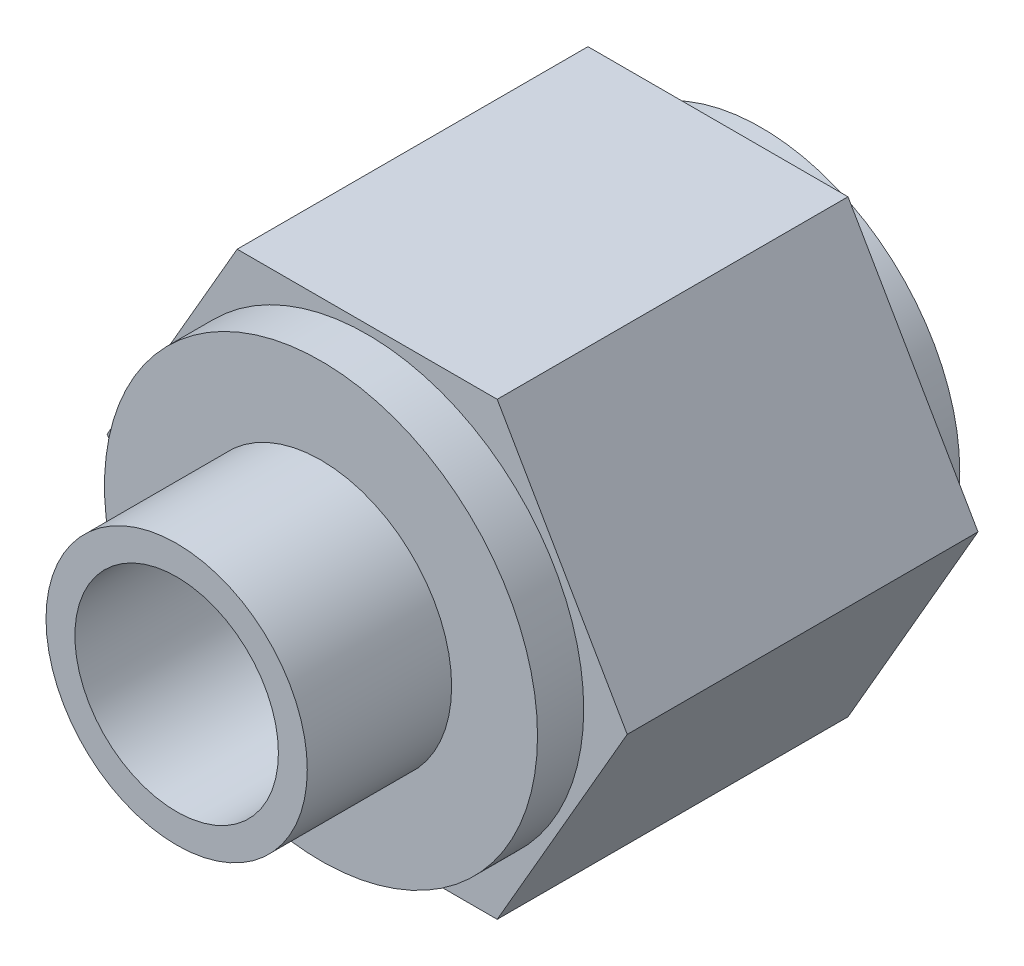
ISO-10303-21;
HEADER;
FILE_DESCRIPTION(('STEP AP214'),'2;1');
FILE_NAME('part.step','',(''),(''),'','','');
FILE_SCHEMA(('AUTOMOTIVE_DESIGN { 1 0 10303 214 1 1 1 1 }'));
ENDSEC;
DATA;
#1=APPLICATION_CONTEXT('core data for automotive mechanical design processes');
#2=APPLICATION_PROTOCOL_DEFINITION('international standard','automotive_design',2000,#1);
#3=PRODUCT_CONTEXT('',#1,'mechanical');
#4=PRODUCT('Part','Part','',(#3));
#5=PRODUCT_RELATED_PRODUCT_CATEGORY('part','',(#4));
#6=PRODUCT_DEFINITION_FORMATION('','',#4);
#7=PRODUCT_DEFINITION_CONTEXT('part definition',#1,'design');
#8=PRODUCT_DEFINITION('design','',#6,#7);
#9=PRODUCT_DEFINITION_SHAPE('','',#8);
#10=(LENGTH_UNIT() NAMED_UNIT(*) SI_UNIT(.MILLI.,.METRE.));
#11=(NAMED_UNIT(*) PLANE_ANGLE_UNIT() SI_UNIT($,.RADIAN.));
#12=(NAMED_UNIT(*) SI_UNIT($,.STERADIAN.) SOLID_ANGLE_UNIT());
#13=UNCERTAINTY_MEASURE_WITH_UNIT(LENGTH_MEASURE(1.E-05),#10,'distance_accuracy_value','');
#14=(GEOMETRIC_REPRESENTATION_CONTEXT(3) GLOBAL_UNCERTAINTY_ASSIGNED_CONTEXT((#13)) GLOBAL_UNIT_ASSIGNED_CONTEXT((#10,
#11,#12)) REPRESENTATION_CONTEXT('',''));
#15=CARTESIAN_POINT('',(0.,0.,0.));
#16=DIRECTION('',(0.,0.,1.));
#17=DIRECTION('',(1.,0.,0.));
#18=AXIS2_PLACEMENT_3D('',#15,#16,#17);
#19=CARTESIAN_POINT('',(0.,0.,-7.51840000000001));
#20=DIRECTION('',(0.,0.,1.));
#21=DIRECTION('',(1.,0.,0.));
#22=AXIS2_PLACEMENT_3D('',#19,#20,#21);
#23=PLANE('',#22);
#24=CARTESIAN_POINT('',(0.,0.,-7.51840000000001));
#25=DIRECTION('',(0.,0.,-1.));
#26=DIRECTION('',(-1.,0.,0.));
#27=AXIS2_PLACEMENT_3D('',#24,#25,#26);
#28=CIRCLE('',#27,3.17500000000001);
#29=CARTESIAN_POINT('',(-3.17500000000001,0.,-7.51840000000001));
#30=VERTEX_POINT('',#29);
#31=EDGE_CURVE('E221',#30,#30,#28,.T.);
#32=ORIENTED_EDGE('',*,*,#31,.T.);
#33=EDGE_LOOP('',(#32));
#34=FACE_BOUND('',#33,.T.);
#35=CARTESIAN_POINT('',(0.,0.,-7.51840000000001));
#36=DIRECTION('',(0.,0.,1.));
#37=DIRECTION('',(1.,0.,0.));
#38=AXIS2_PLACEMENT_3D('',#35,#36,#37);
#39=CIRCLE('',#38,0.381);
#40=CARTESIAN_POINT('',(0.381,0.,-7.51840000000001));
#41=VERTEX_POINT('',#40);
#42=EDGE_CURVE('E11',#41,#41,#39,.F.);
#43=ORIENTED_EDGE('',*,*,#42,.F.);
#44=EDGE_LOOP('',(#43));
#45=FACE_BOUND('',#44,.T.);
#46=ADVANCED_FACE('F40',(#34,#45),#23,.F.);
#47=CARTESIAN_POINT('',(-4.57538541327462,1.78687214890029E-13,-9.525));
#48=DIRECTION('',(0.,0.,1.));
#49=DIRECTION('',(1.,0.,0.));
#50=AXIS2_PLACEMENT_3D('',#47,#48,#49);
#51=PLANE('',#50);
#52=DIRECTION('',(-0.5,-0.866025403784439,0.));
#53=VECTOR('',#52,1.);
#54=CARTESIAN_POINT('',(-2.28769270663755,3.96240000000034,-9.525));
#55=LINE('',#54,#53);
#56=CARTESIAN_POINT('',(-2.28769270663755,3.96240000000034,-9.525));
#57=VERTEX_POINT('',#56);
#58=CARTESIAN_POINT('',(-4.57538541327461,1.77619534868055E-13,-9.525));
#59=VERTEX_POINT('',#58);
#60=EDGE_CURVE('E147',#57,#59,#55,.T.);
#61=ORIENTED_EDGE('',*,*,#60,.F.);
#62=DIRECTION('',(-1.,0.,0.));
#63=VECTOR('',#62,1.);
#64=CARTESIAN_POINT('',(2.28769270663665,3.96240000000034,-9.525));
#65=LINE('',#64,#63);
#66=CARTESIAN_POINT('',(2.28769270663665,3.96240000000034,-9.525));
#67=VERTEX_POINT('',#66);
#68=EDGE_CURVE('E121',#67,#57,#65,.T.);
#69=ORIENTED_EDGE('',*,*,#68,.F.);
#70=DIRECTION('',(-0.5,0.866025403784439,0.));
#71=VECTOR('',#70,1.);
#72=CARTESIAN_POINT('',(4.57538541327394,-2.18400137372289E-13,-9.525));
#73=LINE('',#72,#71);
#74=CARTESIAN_POINT('',(4.57538541327394,-2.18400137372289E-13,-9.525));
#75=VERTEX_POINT('',#74);
#76=EDGE_CURVE('E104',#75,#67,#73,.T.);
#77=ORIENTED_EDGE('',*,*,#76,.F.);
#78=DIRECTION('',(0.5,0.866025403784439,0.));
#79=VECTOR('',#78,1.);
#80=CARTESIAN_POINT('',(2.28769270663688,-3.96240000000036,-9.525));
#81=LINE('',#80,#79);
#82=CARTESIAN_POINT('',(2.28769270663688,-3.96240000000036,-9.525));
#83=VERTEX_POINT('',#82);
#84=EDGE_CURVE('E119',#83,#75,#81,.T.);
#85=ORIENTED_EDGE('',*,*,#84,.F.);
#86=DIRECTION('',(1.,0.,0.));
#87=VECTOR('',#86,1.);
#88=CARTESIAN_POINT('',(-2.28769270663733,-3.96240000000036,-9.525));
#89=LINE('',#88,#87);
#90=CARTESIAN_POINT('',(-2.28769270663733,-3.96240000000036,-9.525));
#91=VERTEX_POINT('',#90);
#92=EDGE_CURVE('E124',#91,#83,#89,.T.);
#93=ORIENTED_EDGE('',*,*,#92,.F.);
#94=DIRECTION('',(0.5,-0.866025403784439,0.));
#95=VECTOR('',#94,1.);
#96=CARTESIAN_POINT('',(-4.57538541327461,1.77619534868055E-13,-9.525));
#97=LINE('',#96,#95);
#98=EDGE_CURVE('E126',#59,#91,#97,.T.);
#99=ORIENTED_EDGE('',*,*,#98,.F.);
#100=EDGE_LOOP('',(#61,#69,#77,#85,#93,#99));
#101=FACE_BOUND('',#100,.T.);
#102=CARTESIAN_POINT('',(0.,0.,-9.525));
#103=DIRECTION('',(0.,0.,1.));
#104=DIRECTION('',(1.,0.,0.));
#105=AXIS2_PLACEMENT_3D('',#102,#103,#104);
#106=CIRCLE('',#105,3.4925);
#107=CARTESIAN_POINT('',(3.4925,0.,-9.525));
#108=VERTEX_POINT('',#107);
#109=EDGE_CURVE('E50',#108,#108,#106,.F.);
#110=ORIENTED_EDGE('',*,*,#109,.F.);
#111=EDGE_LOOP('',(#110));
#112=FACE_BOUND('',#111,.T.);
#113=ADVANCED_FACE('F116',(#101,#112),#51,.F.);
#114=CARTESIAN_POINT('',(0.,0.,-2.54));
#115=DIRECTION('',(0.,0.,1.));
#116=DIRECTION('',(1.,0.,0.));
#117=AXIS2_PLACEMENT_3D('',#114,#115,#116);
#118=PLANE('',#117);
#119=CARTESIAN_POINT('',(0.,0.,-2.54));
#120=DIRECTION('',(0.,0.,1.));
#121=DIRECTION('',(1.,0.,0.));
#122=AXIS2_PLACEMENT_3D('',#119,#120,#121);
#123=CIRCLE('',#122,3.81);
#124=CARTESIAN_POINT('',(3.81,0.,-2.54));
#125=VERTEX_POINT('',#124);
#126=EDGE_CURVE('E135',#125,#125,#123,.T.);
#127=ORIENTED_EDGE('',*,*,#126,.T.);
#128=EDGE_LOOP('',(#127));
#129=FACE_BOUND('',#128,.T.);
#130=CARTESIAN_POINT('',(0.,0.,-2.54));
#131=DIRECTION('',(0.,0.,1.));
#132=DIRECTION('',(1.,0.,0.));
#133=AXIS2_PLACEMENT_3D('',#130,#131,#132);
#134=CIRCLE('',#133,2.2987);
#135=CARTESIAN_POINT('',(2.2987,0.,-2.54));
#136=VERTEX_POINT('',#135);
#137=EDGE_CURVE('E210',#136,#136,#134,.T.);
#138=ORIENTED_EDGE('',*,*,#137,.F.);
#139=EDGE_LOOP('',(#138));
#140=FACE_BOUND('',#139,.T.);
#141=ADVANCED_FACE('F164',(#129,#140),#118,.T.);
#142=CARTESIAN_POINT('',(-4.57538541327462,1.78687214890029E-13,-3.3528));
#143=DIRECTION('',(0.,0.,1.));
#144=DIRECTION('',(1.,0.,0.));
#145=AXIS2_PLACEMENT_3D('',#142,#143,#144);
#146=PLANE('',#145);
#147=DIRECTION('',(-0.5,-0.866025403784439,0.));
#148=VECTOR('',#147,1.);
#149=CARTESIAN_POINT('',(-2.28769270663755,3.96240000000034,-3.3528));
#150=LINE('',#149,#148);
#151=CARTESIAN_POINT('',(-2.28769270663755,3.96240000000034,-3.3528));
#152=VERTEX_POINT('',#151);
#153=CARTESIAN_POINT('',(-4.57538541327461,1.77619534868055E-13,-3.3528));
#154=VERTEX_POINT('',#153);
#155=EDGE_CURVE('E131',#152,#154,#150,.T.);
#156=ORIENTED_EDGE('',*,*,#155,.T.);
#157=DIRECTION('',(0.5,-0.866025403784439,0.));
#158=VECTOR('',#157,1.);
#159=CARTESIAN_POINT('',(-4.57538541327461,1.77619534868055E-13,-3.3528));
#160=LINE('',#159,#158);
#161=CARTESIAN_POINT('',(-2.28769270663733,-3.96240000000036,-3.3528));
#162=VERTEX_POINT('',#161);
#163=EDGE_CURVE('E134',#154,#162,#160,.T.);
#164=ORIENTED_EDGE('',*,*,#163,.T.);
#165=DIRECTION('',(1.,0.,0.));
#166=VECTOR('',#165,1.);
#167=CARTESIAN_POINT('',(-2.28769270663733,-3.96240000000036,-3.3528));
#168=LINE('',#167,#166);
#169=CARTESIAN_POINT('',(2.28769270663688,-3.96240000000036,-3.3528));
#170=VERTEX_POINT('',#169);
#171=EDGE_CURVE('E138',#162,#170,#168,.T.);
#172=ORIENTED_EDGE('',*,*,#171,.T.);
#173=DIRECTION('',(0.5,0.866025403784439,0.));
#174=VECTOR('',#173,1.);
#175=CARTESIAN_POINT('',(2.28769270663688,-3.96240000000036,-3.3528));
#176=LINE('',#175,#174);
#177=CARTESIAN_POINT('',(4.57538541327394,-2.18400137372289E-13,-3.3528));
#178=VERTEX_POINT('',#177);
#179=EDGE_CURVE('E141',#170,#178,#176,.T.);
#180=ORIENTED_EDGE('',*,*,#179,.T.);
#181=DIRECTION('',(-0.5,0.866025403784439,0.));
#182=VECTOR('',#181,1.);
#183=CARTESIAN_POINT('',(4.57538541327394,-2.18400137372289E-13,-3.3528));
#184=LINE('',#183,#182);
#185=CARTESIAN_POINT('',(2.28769270663665,3.96240000000034,-3.3528));
#186=VERTEX_POINT('',#185);
#187=EDGE_CURVE('E106',#178,#186,#184,.T.);
#188=ORIENTED_EDGE('',*,*,#187,.T.);
#189=DIRECTION('',(-1.,0.,0.));
#190=VECTOR('',#189,1.);
#191=CARTESIAN_POINT('',(2.28769270663665,3.96240000000034,-3.3528));
#192=LINE('',#191,#190);
#193=EDGE_CURVE('E144',#186,#152,#192,.T.);
#194=ORIENTED_EDGE('',*,*,#193,.T.);
#195=EDGE_LOOP('',(#156,#164,#172,#180,#188,#194));
#196=FACE_BOUND('',#195,.T.);
#197=CARTESIAN_POINT('',(0.,0.,-3.3528));
#198=DIRECTION('',(0.,0.,1.));
#199=DIRECTION('',(1.,0.,0.));
#200=AXIS2_PLACEMENT_3D('',#197,#198,#199);
#201=CIRCLE('',#200,3.81);
#202=CARTESIAN_POINT('',(3.81,0.,-3.3528));
#203=VERTEX_POINT('',#202);
#204=EDGE_CURVE('E202',#203,#203,#201,.T.);
#205=ORIENTED_EDGE('',*,*,#204,.F.);
#206=EDGE_LOOP('',(#205));
#207=FACE_BOUND('',#206,.T.);
#208=ADVANCED_FACE('F170',(#196,#207),#146,.T.);
#209=CARTESIAN_POINT('',(-2.28769270663755,3.96240000000034,-9.525));
#210=DIRECTION('',(-0.866025403784439,0.5,0.));
#211=DIRECTION('',(-0.5,-0.866025403784439,0.));
#212=AXIS2_PLACEMENT_3D('',#209,#210,#211);
#213=PLANE('',#212);
#214=ORIENTED_EDGE('',*,*,#155,.F.);
#215=DIRECTION('',(0.,0.,1.));
#216=VECTOR('',#215,1.);
#217=CARTESIAN_POINT('',(-2.28769270663755,3.96240000000034,-9.525));
#218=LINE('',#217,#216);
#219=EDGE_CURVE('E58',#57,#152,#218,.T.);
#220=ORIENTED_EDGE('',*,*,#219,.F.);
#221=ORIENTED_EDGE('',*,*,#60,.T.);
#222=DIRECTION('',(0.,0.,1.));
#223=VECTOR('',#222,1.);
#224=CARTESIAN_POINT('',(-4.57538541327461,1.77619534868055E-13,-9.525));
#225=LINE('',#224,#223);
#226=EDGE_CURVE('E93',#59,#154,#225,.T.);
#227=ORIENTED_EDGE('',*,*,#226,.T.);
#228=EDGE_LOOP('',(#214,#220,#221,#227));
#229=FACE_BOUND('',#228,.T.);
#230=ADVANCED_FACE('F42',(#229),#213,.T.);
#231=CARTESIAN_POINT('',(2.28769270663665,3.96240000000034,-9.525));
#232=DIRECTION('',(0.,1.,0.));
#233=DIRECTION('',(0.,0.,1.));
#234=AXIS2_PLACEMENT_3D('',#231,#232,#233);
#235=PLANE('',#234);
#236=ORIENTED_EDGE('',*,*,#193,.F.);
#237=DIRECTION('',(0.,0.,1.));
#238=VECTOR('',#237,1.);
#239=CARTESIAN_POINT('',(2.28769270663665,3.96240000000034,-9.525));
#240=LINE('',#239,#238);
#241=EDGE_CURVE('E81',#67,#186,#240,.T.);
#242=ORIENTED_EDGE('',*,*,#241,.F.);
#243=ORIENTED_EDGE('',*,*,#68,.T.);
#244=ORIENTED_EDGE('',*,*,#219,.T.);
#245=EDGE_LOOP('',(#236,#242,#243,#244));
#246=FACE_BOUND('',#245,.T.);
#247=ADVANCED_FACE('F181',(#246),#235,.T.);
#248=CARTESIAN_POINT('',(4.57538541327394,-2.18400137372289E-13,-9.525));
#249=DIRECTION('',(0.866025403784439,0.5,0.));
#250=DIRECTION('',(-0.5,0.866025403784439,0.));
#251=AXIS2_PLACEMENT_3D('',#248,#249,#250);
#252=PLANE('',#251);
#253=ORIENTED_EDGE('',*,*,#187,.F.);
#254=DIRECTION('',(0.,0.,1.));
#255=VECTOR('',#254,1.);
#256=CARTESIAN_POINT('',(4.57538541327394,-2.18400137372289E-13,-9.525));
#257=LINE('',#256,#255);
#258=EDGE_CURVE('E101',#75,#178,#257,.T.);
#259=ORIENTED_EDGE('',*,*,#258,.F.);
#260=ORIENTED_EDGE('',*,*,#76,.T.);
#261=ORIENTED_EDGE('',*,*,#241,.T.);
#262=EDGE_LOOP('',(#253,#259,#260,#261));
#263=FACE_BOUND('',#262,.T.);
#264=ADVANCED_FACE('F103',(#263),#252,.T.);
#265=CARTESIAN_POINT('',(2.28769270663688,-3.96240000000036,-9.525));
#266=DIRECTION('',(0.866025403784439,-0.5,0.));
#267=DIRECTION('',(0.5,0.866025403784439,0.));
#268=AXIS2_PLACEMENT_3D('',#265,#266,#267);
#269=PLANE('',#268);
#270=ORIENTED_EDGE('',*,*,#179,.F.);
#271=DIRECTION('',(0.,0.,1.));
#272=VECTOR('',#271,1.);
#273=CARTESIAN_POINT('',(2.28769270663688,-3.96240000000036,-9.525));
#274=LINE('',#273,#272);
#275=EDGE_CURVE('E112',#83,#170,#274,.T.);
#276=ORIENTED_EDGE('',*,*,#275,.F.);
#277=ORIENTED_EDGE('',*,*,#84,.T.);
#278=ORIENTED_EDGE('',*,*,#258,.T.);
#279=EDGE_LOOP('',(#270,#276,#277,#278));
#280=FACE_BOUND('',#279,.T.);
#281=ADVANCED_FACE('F123',(#280),#269,.T.);
#282=CARTESIAN_POINT('',(-2.28769270663733,-3.96240000000036,-9.525));
#283=DIRECTION('',(0.,-1.,0.));
#284=DIRECTION('',(0.,0.,-1.));
#285=AXIS2_PLACEMENT_3D('',#282,#283,#284);
#286=PLANE('',#285);
#287=ORIENTED_EDGE('',*,*,#171,.F.);
#288=DIRECTION('',(0.,0.,1.));
#289=VECTOR('',#288,1.);
#290=CARTESIAN_POINT('',(-2.28769270663733,-3.96240000000036,-9.525));
#291=LINE('',#290,#289);
#292=EDGE_CURVE('E153',#91,#162,#291,.T.);
#293=ORIENTED_EDGE('',*,*,#292,.F.);
#294=ORIENTED_EDGE('',*,*,#92,.T.);
#295=ORIENTED_EDGE('',*,*,#275,.T.);
#296=EDGE_LOOP('',(#287,#293,#294,#295));
#297=FACE_BOUND('',#296,.T.);
#298=ADVANCED_FACE('F188',(#297),#286,.T.);
#299=CARTESIAN_POINT('',(-4.57538541327461,1.77619534868055E-13,-9.525));
#300=DIRECTION('',(-0.866025403784439,-0.5,0.));
#301=DIRECTION('',(0.5,-0.866025403784439,0.));
#302=AXIS2_PLACEMENT_3D('',#299,#300,#301);
#303=PLANE('',#302);
#304=ORIENTED_EDGE('',*,*,#163,.F.);
#305=ORIENTED_EDGE('',*,*,#226,.F.);
#306=ORIENTED_EDGE('',*,*,#98,.T.);
#307=ORIENTED_EDGE('',*,*,#292,.T.);
#308=EDGE_LOOP('',(#304,#305,#306,#307));
#309=FACE_BOUND('',#308,.T.);
#310=ADVANCED_FACE('F190',(#309),#303,.T.);
#311=CARTESIAN_POINT('',(0.,0.,-2.54));
#312=DIRECTION('',(0.,0.,-1.));
#313=DIRECTION('',(-1.,0.,0.));
#314=AXIS2_PLACEMENT_3D('',#311,#312,#313);
#315=CYLINDRICAL_SURFACE('',#314,3.81);
#316=ORIENTED_EDGE('',*,*,#126,.F.);
#317=EDGE_LOOP('',(#316));
#318=FACE_BOUND('',#317,.T.);
#319=ORIENTED_EDGE('',*,*,#204,.T.);
#320=EDGE_LOOP('',(#319));
#321=FACE_BOUND('',#320,.T.);
#322=ADVANCED_FACE('F177',(#318,#321),#315,.T.);
#323=CARTESIAN_POINT('',(0.,0.,0.));
#324=DIRECTION('',(0.,0.,-1.));
#325=DIRECTION('',(-1.,0.,0.));
#326=AXIS2_PLACEMENT_3D('',#323,#324,#325);
#327=CYLINDRICAL_SURFACE('',#326,2.2987);
#328=CARTESIAN_POINT('',(0.,0.,0.));
#329=DIRECTION('',(0.,0.,1.));
#330=DIRECTION('',(1.,0.,0.));
#331=AXIS2_PLACEMENT_3D('',#328,#329,#330);
#332=CIRCLE('',#331,2.2987);
#333=CARTESIAN_POINT('',(2.2987,0.,0.));
#334=VERTEX_POINT('',#333);
#335=EDGE_CURVE('E206',#334,#334,#332,.T.);
#336=ORIENTED_EDGE('',*,*,#335,.F.);
#337=EDGE_LOOP('',(#336));
#338=FACE_BOUND('',#337,.T.);
#339=ORIENTED_EDGE('',*,*,#137,.T.);
#340=EDGE_LOOP('',(#339));
#341=FACE_BOUND('',#340,.T.);
#342=ADVANCED_FACE('F196',(#338,#341),#327,.T.);
#343=CARTESIAN_POINT('',(0.,0.,0.));
#344=DIRECTION('',(0.,0.,1.));
#345=DIRECTION('',(1.,0.,0.));
#346=AXIS2_PLACEMENT_3D('',#343,#344,#345);
#347=PLANE('',#346);
#348=CARTESIAN_POINT('',(0.,0.,0.));
#349=DIRECTION('',(0.,0.,1.));
#350=DIRECTION('',(1.,0.,0.));
#351=AXIS2_PLACEMENT_3D('',#348,#349,#350);
#352=CIRCLE('',#351,1.7907);
#353=CARTESIAN_POINT('',(1.7907,0.,0.));
#354=VERTEX_POINT('',#353);
#355=EDGE_CURVE('E235',#354,#354,#352,.T.);
#356=ORIENTED_EDGE('',*,*,#355,.F.);
#357=EDGE_LOOP('',(#356));
#358=FACE_BOUND('',#357,.T.);
#359=ORIENTED_EDGE('',*,*,#335,.T.);
#360=EDGE_LOOP('',(#359));
#361=FACE_BOUND('',#360,.T.);
#362=ADVANCED_FACE('F241',(#358,#361),#347,.T.);
#363=CARTESIAN_POINT('',(0.,0.,-10.287));
#364=DIRECTION('',(0.,0.,1.));
#365=DIRECTION('',(1.,0.,0.));
#366=AXIS2_PLACEMENT_3D('',#363,#364,#365);
#367=CYLINDRICAL_SURFACE('',#366,3.4925);
#368=CARTESIAN_POINT('',(0.,0.,-10.287));
#369=DIRECTION('',(0.,0.,-1.));
#370=DIRECTION('',(-1.,0.,0.));
#371=AXIS2_PLACEMENT_3D('',#368,#369,#370);
#372=CIRCLE('',#371,3.4925);
#373=CARTESIAN_POINT('',(-3.4925,0.,-10.287));
#374=VERTEX_POINT('',#373);
#375=EDGE_CURVE('E214',#374,#374,#372,.T.);
#376=ORIENTED_EDGE('',*,*,#375,.F.);
#377=EDGE_LOOP('',(#376));
#378=FACE_BOUND('',#377,.T.);
#379=ORIENTED_EDGE('',*,*,#109,.T.);
#380=EDGE_LOOP('',(#379));
#381=FACE_BOUND('',#380,.T.);
#382=ADVANCED_FACE('F162',(#378,#381),#367,.T.);
#383=CARTESIAN_POINT('',(0.,0.,-10.287));
#384=DIRECTION('',(0.,0.,-1.));
#385=DIRECTION('',(-1.,0.,0.));
#386=AXIS2_PLACEMENT_3D('',#383,#384,#385);
#387=PLANE('',#386);
#388=CARTESIAN_POINT('',(0.,0.,-10.287));
#389=DIRECTION('',(0.,0.,-1.));
#390=DIRECTION('',(-1.,0.,0.));
#391=AXIS2_PLACEMENT_3D('',#388,#389,#390);
#392=CIRCLE('',#391,3.17500000000001);
#393=CARTESIAN_POINT('',(-3.17500000000001,0.,-10.287));
#394=VERTEX_POINT('',#393);
#395=EDGE_CURVE('E225',#394,#394,#392,.T.);
#396=ORIENTED_EDGE('',*,*,#395,.F.);
#397=EDGE_LOOP('',(#396));
#398=FACE_BOUND('',#397,.T.);
#399=ORIENTED_EDGE('',*,*,#375,.T.);
#400=EDGE_LOOP('',(#399));
#401=FACE_BOUND('',#400,.T.);
#402=ADVANCED_FACE('F257',(#398,#401),#387,.T.);
#403=CARTESIAN_POINT('',(0.,0.,-10.287));
#404=DIRECTION('',(0.,0.,-1.));
#405=DIRECTION('',(-1.,0.,0.));
#406=AXIS2_PLACEMENT_3D('',#403,#404,#405);
#407=CYLINDRICAL_SURFACE('',#406,3.17500000000001);
#408=ORIENTED_EDGE('',*,*,#31,.F.);
#409=EDGE_LOOP('',(#408));
#410=FACE_BOUND('',#409,.T.);
#411=ORIENTED_EDGE('',*,*,#395,.T.);
#412=EDGE_LOOP('',(#411));
#413=FACE_BOUND('',#412,.T.);
#414=ADVANCED_FACE('F260',(#410,#413),#407,.F.);
#415=CARTESIAN_POINT('',(0.,0.,-9.75360000000001));
#416=DIRECTION('',(0.,0.,1.));
#417=DIRECTION('',(1.,0.,0.));
#418=AXIS2_PLACEMENT_3D('',#415,#416,#417);
#419=CYLINDRICAL_SURFACE('',#418,0.381);
#420=CARTESIAN_POINT('',(0.,0.,-9.75360000000001));
#421=DIRECTION('',(0.,0.,-1.));
#422=DIRECTION('',(-1.,0.,0.));
#423=AXIS2_PLACEMENT_3D('',#420,#421,#422);
#424=CIRCLE('',#423,0.381);
#425=CARTESIAN_POINT('',(-0.381,0.,-9.75360000000001));
#426=VERTEX_POINT('',#425);
#427=EDGE_CURVE('E229',#426,#426,#424,.T.);
#428=ORIENTED_EDGE('',*,*,#427,.F.);
#429=EDGE_LOOP('',(#428));
#430=FACE_BOUND('',#429,.T.);
#431=ORIENTED_EDGE('',*,*,#42,.T.);
#432=EDGE_LOOP('',(#431));
#433=FACE_BOUND('',#432,.T.);
#434=ADVANCED_FACE('F265',(#430,#433),#419,.T.);
#435=CARTESIAN_POINT('',(0.,0.,-9.75360000000001));
#436=DIRECTION('',(0.,0.,-1.));
#437=DIRECTION('',(-1.,0.,0.));
#438=AXIS2_PLACEMENT_3D('',#435,#436,#437);
#439=PLANE('',#438);
#440=ORIENTED_EDGE('',*,*,#427,.T.);
#441=EDGE_LOOP('',(#440));
#442=FACE_BOUND('',#441,.T.);
#443=ADVANCED_FACE('F269',(#442),#439,.T.);
#444=CARTESIAN_POINT('',(0.,0.,-7.604864452283));
#445=DIRECTION('',(0.,0.,1.));
#446=DIRECTION('',(1.,0.,0.));
#447=AXIS2_PLACEMENT_3D('',#444,#445,#446);
#448=CYLINDRICAL_SURFACE('',#447,1.7907);
#449=CARTESIAN_POINT('',(0.,0.,-2.54));
#450=DIRECTION('',(0.,0.,1.));
#451=DIRECTION('',(1.,0.,0.));
#452=AXIS2_PLACEMENT_3D('',#449,#450,#451);
#453=CIRCLE('',#452,1.7907);
#454=CARTESIAN_POINT('',(1.7907,0.,-2.54));
#455=VERTEX_POINT('',#454);
#456=EDGE_CURVE('E232',#455,#455,#453,.F.);
#457=ORIENTED_EDGE('',*,*,#456,.T.);
#458=EDGE_LOOP('',(#457));
#459=FACE_BOUND('',#458,.T.);
#460=ORIENTED_EDGE('',*,*,#355,.T.);
#461=EDGE_LOOP('',(#460));
#462=FACE_BOUND('',#461,.T.);
#463=ADVANCED_FACE('F239',(#459,#462),#448,.F.);
#464=CARTESIAN_POINT('',(0.,0.,-2.54));
#465=DIRECTION('',(0.,0.,1.));
#466=DIRECTION('',(1.,0.,0.));
#467=AXIS2_PLACEMENT_3D('',#464,#465,#466);
#468=PLANE('',#467);
#469=ORIENTED_EDGE('',*,*,#456,.F.);
#470=EDGE_LOOP('',(#469));
#471=FACE_BOUND('',#470,.T.);
#472=ADVANCED_FACE('F276',(#471),#468,.T.);
#473=CLOSED_SHELL('',(#46,#113,#141,#208,#230,#247,#264,#281,#298,#310,#322,#342,#362,#382,#402,
#414,#434,#443,#463,#472));
#474=MANIFOLD_SOLID_BREP('B2',#473);
#475=ADVANCED_BREP_SHAPE_REPRESENTATION('',(#18,#474),#14);
#476=SHAPE_DEFINITION_REPRESENTATION(#9,#475);
ENDSEC;
END-ISO-10303-21;
